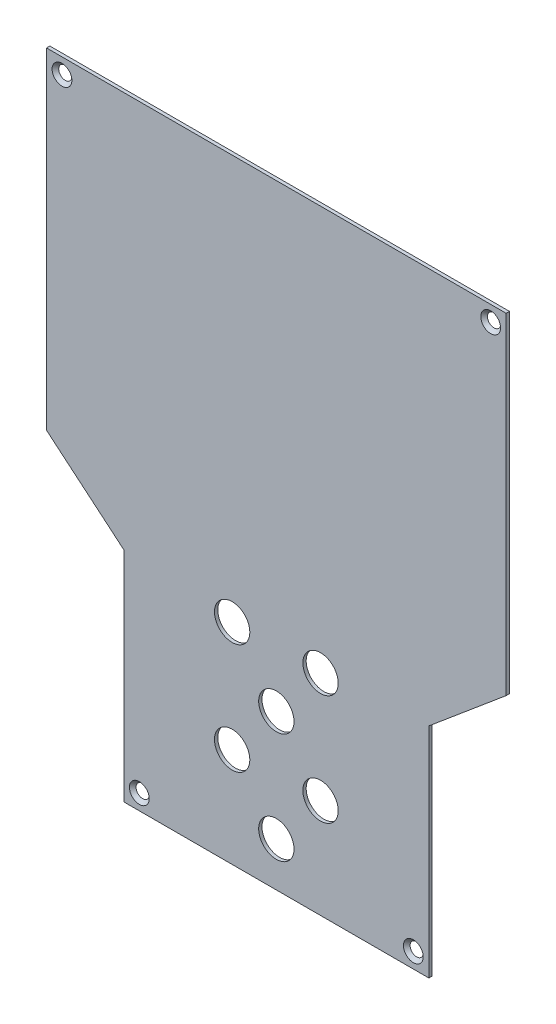
ISO-10303-21;
HEADER;
FILE_DESCRIPTION(('STEP AP214'),'2;1');
FILE_NAME('part.step','',(''),(''),'','','');
FILE_SCHEMA(('AUTOMOTIVE_DESIGN { 1 0 10303 214 1 1 1 1 }'));
ENDSEC;
DATA;
#1=APPLICATION_CONTEXT('core data for automotive mechanical design processes');
#2=APPLICATION_PROTOCOL_DEFINITION('international standard','automotive_design',2000,#1);
#3=PRODUCT_CONTEXT('',#1,'mechanical');
#4=PRODUCT('Part','Part','',(#3));
#5=PRODUCT_RELATED_PRODUCT_CATEGORY('part','',(#4));
#6=PRODUCT_DEFINITION_FORMATION('','',#4);
#7=PRODUCT_DEFINITION_CONTEXT('part definition',#1,'design');
#8=PRODUCT_DEFINITION('design','',#6,#7);
#9=PRODUCT_DEFINITION_SHAPE('','',#8);
#10=(LENGTH_UNIT() NAMED_UNIT(*) SI_UNIT(.MILLI.,.METRE.));
#11=(NAMED_UNIT(*) PLANE_ANGLE_UNIT() SI_UNIT($,.RADIAN.));
#12=(NAMED_UNIT(*) SI_UNIT($,.STERADIAN.) SOLID_ANGLE_UNIT());
#13=UNCERTAINTY_MEASURE_WITH_UNIT(LENGTH_MEASURE(1.E-05),#10,'distance_accuracy_value','');
#14=(GEOMETRIC_REPRESENTATION_CONTEXT(3) GLOBAL_UNCERTAINTY_ASSIGNED_CONTEXT((#13)) GLOBAL_UNIT_ASSIGNED_CONTEXT((#10,
#11,#12)) REPRESENTATION_CONTEXT('',''));
#15=CARTESIAN_POINT('',(0.,0.,0.));
#16=DIRECTION('',(0.,0.,1.));
#17=DIRECTION('',(1.,0.,0.));
#18=AXIS2_PLACEMENT_3D('',#15,#16,#17);
#19=CARTESIAN_POINT('',(0.,0.,0.));
#20=DIRECTION('',(0.,0.,1.));
#21=DIRECTION('',(1.,0.,0.));
#22=AXIS2_PLACEMENT_3D('',#19,#20,#21);
#23=PLANE('',#22);
#24=CARTESIAN_POINT('',(-100.139052355036,133.996609124538,0.));
#25=DIRECTION('',(0.,0.,1.));
#26=DIRECTION('',(1.,0.,0.));
#27=AXIS2_PLACEMENT_3D('',#24,#25,#26);
#28=CIRCLE('',#27,2.98);
#29=CARTESIAN_POINT('',(-97.1590523550359,133.996609124538,0.));
#30=VERTEX_POINT('',#29);
#31=EDGE_CURVE('E230',#30,#30,#28,.T.);
#32=ORIENTED_EDGE('',*,*,#31,.T.);
#33=EDGE_LOOP('',(#32));
#34=FACE_BOUND('',#33,.T.);
#35=CARTESIAN_POINT('',(58.860947644964,-130.003390875462,0.));
#36=DIRECTION('',(0.,0.,1.));
#37=DIRECTION('',(1.,0.,0.));
#38=AXIS2_PLACEMENT_3D('',#35,#36,#37);
#39=CIRCLE('',#38,2.98);
#40=CARTESIAN_POINT('',(61.840947644964,-130.003390875462,0.));
#41=VERTEX_POINT('',#40);
#42=EDGE_CURVE('E218',#41,#41,#39,.T.);
#43=ORIENTED_EDGE('',*,*,#42,.T.);
#44=EDGE_LOOP('',(#43));
#45=FACE_BOUND('',#44,.T.);
#46=CARTESIAN_POINT('',(-65.1390523550359,-130.003390875462,0.));
#47=DIRECTION('',(0.,0.,1.));
#48=DIRECTION('',(1.,0.,0.));
#49=AXIS2_PLACEMENT_3D('',#46,#47,#48);
#50=CIRCLE('',#49,2.98);
#51=CARTESIAN_POINT('',(-62.1590523550359,-130.003390875462,0.));
#52=VERTEX_POINT('',#51);
#53=EDGE_CURVE('E37',#52,#52,#50,.T.);
#54=ORIENTED_EDGE('',*,*,#53,.T.);
#55=EDGE_LOOP('',(#54));
#56=FACE_BOUND('',#55,.T.);
#57=DIRECTION('',(0.,1.,0.));
#58=VECTOR('',#57,1.);
#59=CARTESIAN_POINT('',(65.860947644964,-38.2109300542074,0.));
#60=LINE('',#59,#58);
#61=CARTESIAN_POINT('',(65.860947644964,-137.003390875462,0.));
#62=VERTEX_POINT('',#61);
#63=CARTESIAN_POINT('',(65.860947644964,-38.2109300542074,0.));
#64=VERTEX_POINT('',#63);
#65=EDGE_CURVE('E131',#62,#64,#60,.T.);
#66=ORIENTED_EDGE('',*,*,#65,.F.);
#67=DIRECTION('',(1.,0.,0.));
#68=VECTOR('',#67,1.);
#69=CARTESIAN_POINT('',(-72.1390523550359,-137.003390875462,0.));
#70=LINE('',#69,#68);
#71=CARTESIAN_POINT('',(-72.1390523550359,-137.003390875462,0.));
#72=VERTEX_POINT('',#71);
#73=EDGE_CURVE('E86',#72,#62,#70,.T.);
#74=ORIENTED_EDGE('',*,*,#73,.F.);
#75=DIRECTION('',(0.,-1.,0.));
#76=VECTOR('',#75,1.);
#77=CARTESIAN_POINT('',(-72.1390523550359,-38.2109300542074,0.));
#78=LINE('',#77,#76);
#79=CARTESIAN_POINT('',(-72.1390523550359,-38.2109300542074,0.));
#80=VERTEX_POINT('',#79);
#81=EDGE_CURVE('E80',#80,#72,#78,.T.);
#82=ORIENTED_EDGE('',*,*,#81,.F.);
#83=DIRECTION('',(0.766044443118979,-0.642787609686538,0.));
#84=VECTOR('',#83,1.);
#85=CARTESIAN_POINT('',(-107.139052355036,-8.84244296300268,0.));
#86=LINE('',#85,#84);
#87=CARTESIAN_POINT('',(-107.139052355036,-8.84244296300268,0.));
#88=VERTEX_POINT('',#87);
#89=EDGE_CURVE('E121',#88,#80,#86,.T.);
#90=ORIENTED_EDGE('',*,*,#89,.F.);
#91=DIRECTION('',(0.,-1.,0.));
#92=VECTOR('',#91,1.);
#93=CARTESIAN_POINT('',(-107.139052355036,140.996609124538,0.));
#94=LINE('',#93,#92);
#95=CARTESIAN_POINT('',(-107.139052355036,140.996609124538,0.));
#96=VERTEX_POINT('',#95);
#97=EDGE_CURVE('E141',#96,#88,#94,.T.);
#98=ORIENTED_EDGE('',*,*,#97,.F.);
#99=DIRECTION('',(-1.,0.,0.));
#100=VECTOR('',#99,1.);
#101=CARTESIAN_POINT('',(100.860947644964,140.996609124538,0.));
#102=LINE('',#101,#100);
#103=CARTESIAN_POINT('',(100.860947644964,140.996609124538,0.));
#104=VERTEX_POINT('',#103);
#105=EDGE_CURVE('E139',#104,#96,#102,.T.);
#106=ORIENTED_EDGE('',*,*,#105,.F.);
#107=DIRECTION('',(0.,1.,0.));
#108=VECTOR('',#107,1.);
#109=CARTESIAN_POINT('',(100.860947644964,140.996609124538,0.));
#110=LINE('',#109,#108);
#111=CARTESIAN_POINT('',(100.860947644964,-8.84244296300268,0.));
#112=VERTEX_POINT('',#111);
#113=EDGE_CURVE('E137',#112,#104,#110,.T.);
#114=ORIENTED_EDGE('',*,*,#113,.F.);
#115=DIRECTION('',(0.766044443118979,0.642787609686538,0.));
#116=VECTOR('',#115,1.);
#117=CARTESIAN_POINT('',(100.860947644964,-8.84244296300268,0.));
#118=LINE('',#117,#116);
#119=EDGE_CURVE('E134',#64,#112,#118,.T.);
#120=ORIENTED_EDGE('',*,*,#119,.F.);
#121=EDGE_LOOP('',(#66,#74,#82,#90,#98,#106,#114,#120));
#122=FACE_BOUND('',#121,.T.);
#123=CARTESIAN_POINT('',(-3.13905235503593,-117.003390875462,0.));
#124=DIRECTION('',(0.,0.,1.));
#125=DIRECTION('',(1.,0.,0.));
#126=AXIS2_PLACEMENT_3D('',#123,#124,#125);
#127=CIRCLE('',#126,8.00000000000001);
#128=CARTESIAN_POINT('',(4.86094764496407,-117.003390875462,0.));
#129=VERTEX_POINT('',#128);
#130=EDGE_CURVE('E135',#129,#129,#127,.T.);
#131=ORIENTED_EDGE('',*,*,#130,.T.);
#132=EDGE_LOOP('',(#131));
#133=FACE_BOUND('',#132,.T.);
#134=CARTESIAN_POINT('',(16.8609476449641,-42.0033908754623,0.));
#135=DIRECTION('',(0.,0.,1.));
#136=DIRECTION('',(-1.,0.,0.));
#137=AXIS2_PLACEMENT_3D('',#134,#135,#136);
#138=CIRCLE('',#137,8.);
#139=CARTESIAN_POINT('',(8.86094764496406,-42.0033908754623,0.));
#140=VERTEX_POINT('',#139);
#141=EDGE_CURVE('E183',#140,#140,#138,.T.);
#142=ORIENTED_EDGE('',*,*,#141,.T.);
#143=EDGE_LOOP('',(#142));
#144=FACE_BOUND('',#143,.T.);
#145=CARTESIAN_POINT('',(-23.1390523550359,-92.0033908754623,0.));
#146=DIRECTION('',(0.,0.,1.));
#147=DIRECTION('',(1.,0.,0.));
#148=AXIS2_PLACEMENT_3D('',#145,#146,#147);
#149=CIRCLE('',#148,8.00000000000002);
#150=CARTESIAN_POINT('',(-15.1390523550359,-92.0033908754623,0.));
#151=VERTEX_POINT('',#150);
#152=EDGE_CURVE('E189',#151,#151,#149,.T.);
#153=ORIENTED_EDGE('',*,*,#152,.T.);
#154=EDGE_LOOP('',(#153));
#155=FACE_BOUND('',#154,.T.);
#156=CARTESIAN_POINT('',(-3.13905235503593,-67.0033908754623,0.));
#157=DIRECTION('',(0.,0.,1.));
#158=DIRECTION('',(1.,0.,0.));
#159=AXIS2_PLACEMENT_3D('',#156,#157,#158);
#160=CIRCLE('',#159,8.00000000000001);
#161=CARTESIAN_POINT('',(4.86094764496408,-67.0033908754623,0.));
#162=VERTEX_POINT('',#161);
#163=EDGE_CURVE('E195',#162,#162,#160,.T.);
#164=ORIENTED_EDGE('',*,*,#163,.T.);
#165=EDGE_LOOP('',(#164));
#166=FACE_BOUND('',#165,.T.);
#167=CARTESIAN_POINT('',(16.8609476449641,-92.0033908754623,0.));
#168=DIRECTION('',(0.,0.,1.));
#169=DIRECTION('',(-1.,0.,0.));
#170=AXIS2_PLACEMENT_3D('',#167,#168,#169);
#171=CIRCLE('',#170,8.00000000000001);
#172=CARTESIAN_POINT('',(8.86094764496405,-92.0033908754623,0.));
#173=VERTEX_POINT('',#172);
#174=EDGE_CURVE('E201',#173,#173,#171,.T.);
#175=ORIENTED_EDGE('',*,*,#174,.T.);
#176=EDGE_LOOP('',(#175));
#177=FACE_BOUND('',#176,.T.);
#178=CARTESIAN_POINT('',(-23.1390523550359,-42.0033908754623,0.));
#179=DIRECTION('',(0.,0.,1.));
#180=DIRECTION('',(1.,0.,0.));
#181=AXIS2_PLACEMENT_3D('',#178,#179,#180);
#182=CIRCLE('',#181,8.);
#183=CARTESIAN_POINT('',(-15.1390523550359,-42.0033908754623,0.));
#184=VERTEX_POINT('',#183);
#185=EDGE_CURVE('E207',#184,#184,#182,.T.);
#186=ORIENTED_EDGE('',*,*,#185,.T.);
#187=EDGE_LOOP('',(#186));
#188=FACE_BOUND('',#187,.T.);
#189=CARTESIAN_POINT('',(93.8609476449641,133.996609124538,0.));
#190=DIRECTION('',(0.,0.,1.));
#191=DIRECTION('',(1.,0.,0.));
#192=AXIS2_PLACEMENT_3D('',#189,#190,#191);
#193=CIRCLE('',#192,2.98);
#194=CARTESIAN_POINT('',(96.840947644964,133.996609124538,0.));
#195=VERTEX_POINT('',#194);
#196=EDGE_CURVE('E224',#195,#195,#193,.T.);
#197=ORIENTED_EDGE('',*,*,#196,.T.);
#198=EDGE_LOOP('',(#197));
#199=FACE_BOUND('',#198,.T.);
#200=ADVANCED_FACE('F33',(#34,#45,#56,#122,#133,#144,#155,#166,#177,#188,#199),#23,.F.);
#201=CARTESIAN_POINT('',(65.860947644964,-38.2109300542074,1.5));
#202=DIRECTION('',(-1.,0.,0.));
#203=DIRECTION('',(0.,-1.,0.));
#204=AXIS2_PLACEMENT_3D('',#201,#202,#203);
#205=PLANE('',#204);
#206=ORIENTED_EDGE('',*,*,#65,.T.);
#207=DIRECTION('',(0.,0.,-1.));
#208=VECTOR('',#207,1.);
#209=CARTESIAN_POINT('',(65.860947644964,-38.2109300542074,1.5));
#210=LINE('',#209,#208);
#211=CARTESIAN_POINT('',(65.860947644964,-38.2109300542074,1.5));
#212=VERTEX_POINT('',#211);
#213=EDGE_CURVE('E11',#212,#64,#210,.T.);
#214=ORIENTED_EDGE('',*,*,#213,.F.);
#215=DIRECTION('',(0.,1.,0.));
#216=VECTOR('',#215,1.);
#217=CARTESIAN_POINT('',(65.860947644964,-38.2109300542074,1.5));
#218=LINE('',#217,#216);
#219=CARTESIAN_POINT('',(65.860947644964,-137.003390875462,1.5));
#220=VERTEX_POINT('',#219);
#221=EDGE_CURVE('E146',#220,#212,#218,.T.);
#222=ORIENTED_EDGE('',*,*,#221,.F.);
#223=DIRECTION('',(0.,0.,-1.));
#224=VECTOR('',#223,1.);
#225=CARTESIAN_POINT('',(65.860947644964,-137.003390875462,1.5));
#226=LINE('',#225,#224);
#227=EDGE_CURVE('E127',#220,#62,#226,.T.);
#228=ORIENTED_EDGE('',*,*,#227,.T.);
#229=EDGE_LOOP('',(#206,#214,#222,#228));
#230=FACE_BOUND('',#229,.T.);
#231=ADVANCED_FACE('F35',(#230),#205,.F.);
#232=CARTESIAN_POINT('',(100.860947644964,-8.84244296300268,1.5));
#233=DIRECTION('',(-0.642787609686538,0.766044443118979,0.));
#234=DIRECTION('',(-0.766044443118979,-0.642787609686538,0.));
#235=AXIS2_PLACEMENT_3D('',#232,#233,#234);
#236=PLANE('',#235);
#237=ORIENTED_EDGE('',*,*,#119,.T.);
#238=DIRECTION('',(0.,0.,-1.));
#239=VECTOR('',#238,1.);
#240=CARTESIAN_POINT('',(100.860947644964,-8.84244296300268,1.5));
#241=LINE('',#240,#239);
#242=CARTESIAN_POINT('',(100.860947644964,-8.84244296300268,1.5));
#243=VERTEX_POINT('',#242);
#244=EDGE_CURVE('E43',#243,#112,#241,.T.);
#245=ORIENTED_EDGE('',*,*,#244,.F.);
#246=DIRECTION('',(0.766044443118979,0.642787609686538,0.));
#247=VECTOR('',#246,1.);
#248=CARTESIAN_POINT('',(100.860947644964,-8.84244296300268,1.5));
#249=LINE('',#248,#247);
#250=EDGE_CURVE('E94',#212,#243,#249,.T.);
#251=ORIENTED_EDGE('',*,*,#250,.F.);
#252=ORIENTED_EDGE('',*,*,#213,.T.);
#253=EDGE_LOOP('',(#237,#245,#251,#252));
#254=FACE_BOUND('',#253,.T.);
#255=ADVANCED_FACE('F282',(#254),#236,.F.);
#256=CARTESIAN_POINT('',(100.860947644964,140.996609124538,1.5));
#257=DIRECTION('',(-1.,0.,0.));
#258=DIRECTION('',(0.,-1.,0.));
#259=AXIS2_PLACEMENT_3D('',#256,#257,#258);
#260=PLANE('',#259);
#261=ORIENTED_EDGE('',*,*,#113,.T.);
#262=DIRECTION('',(0.,0.,-1.));
#263=VECTOR('',#262,1.);
#264=CARTESIAN_POINT('',(100.860947644964,140.996609124538,1.5));
#265=LINE('',#264,#263);
#266=CARTESIAN_POINT('',(100.860947644964,140.996609124538,1.5));
#267=VERTEX_POINT('',#266);
#268=EDGE_CURVE('E153',#267,#104,#265,.T.);
#269=ORIENTED_EDGE('',*,*,#268,.F.);
#270=DIRECTION('',(0.,1.,0.));
#271=VECTOR('',#270,1.);
#272=CARTESIAN_POINT('',(100.860947644964,140.996609124538,1.5));
#273=LINE('',#272,#271);
#274=EDGE_CURVE('E162',#243,#267,#273,.T.);
#275=ORIENTED_EDGE('',*,*,#274,.F.);
#276=ORIENTED_EDGE('',*,*,#244,.T.);
#277=EDGE_LOOP('',(#261,#269,#275,#276));
#278=FACE_BOUND('',#277,.T.);
#279=ADVANCED_FACE('F160',(#278),#260,.F.);
#280=CARTESIAN_POINT('',(100.860947644964,140.996609124538,1.5));
#281=DIRECTION('',(0.,-1.,0.));
#282=DIRECTION('',(0.,0.,-1.));
#283=AXIS2_PLACEMENT_3D('',#280,#281,#282);
#284=PLANE('',#283);
#285=ORIENTED_EDGE('',*,*,#105,.T.);
#286=DIRECTION('',(0.,0.,-1.));
#287=VECTOR('',#286,1.);
#288=CARTESIAN_POINT('',(-107.139052355036,140.996609124538,1.5));
#289=LINE('',#288,#287);
#290=CARTESIAN_POINT('',(-107.139052355036,140.996609124538,1.5));
#291=VERTEX_POINT('',#290);
#292=EDGE_CURVE('E150',#291,#96,#289,.T.);
#293=ORIENTED_EDGE('',*,*,#292,.F.);
#294=DIRECTION('',(-1.,0.,0.));
#295=VECTOR('',#294,1.);
#296=CARTESIAN_POINT('',(100.860947644964,140.996609124538,1.5));
#297=LINE('',#296,#295);
#298=EDGE_CURVE('E174',#267,#291,#297,.T.);
#299=ORIENTED_EDGE('',*,*,#298,.F.);
#300=ORIENTED_EDGE('',*,*,#268,.T.);
#301=EDGE_LOOP('',(#285,#293,#299,#300));
#302=FACE_BOUND('',#301,.T.);
#303=ADVANCED_FACE('F170',(#302),#284,.F.);
#304=CARTESIAN_POINT('',(-107.139052355036,140.996609124538,1.5));
#305=DIRECTION('',(1.,0.,0.));
#306=DIRECTION('',(0.,1.,0.));
#307=AXIS2_PLACEMENT_3D('',#304,#305,#306);
#308=PLANE('',#307);
#309=ORIENTED_EDGE('',*,*,#97,.T.);
#310=DIRECTION('',(0.,0.,-1.));
#311=VECTOR('',#310,1.);
#312=CARTESIAN_POINT('',(-107.139052355036,-8.84244296300268,1.5));
#313=LINE('',#312,#311);
#314=CARTESIAN_POINT('',(-107.139052355036,-8.84244296300268,1.5));
#315=VERTEX_POINT('',#314);
#316=EDGE_CURVE('E122',#315,#88,#313,.T.);
#317=ORIENTED_EDGE('',*,*,#316,.F.);
#318=DIRECTION('',(0.,-1.,0.));
#319=VECTOR('',#318,1.);
#320=CARTESIAN_POINT('',(-107.139052355036,140.996609124538,1.5));
#321=LINE('',#320,#319);
#322=EDGE_CURVE('E113',#291,#315,#321,.T.);
#323=ORIENTED_EDGE('',*,*,#322,.F.);
#324=ORIENTED_EDGE('',*,*,#292,.T.);
#325=EDGE_LOOP('',(#309,#317,#323,#324));
#326=FACE_BOUND('',#325,.T.);
#327=ADVANCED_FACE('F173',(#326),#308,.F.);
#328=CARTESIAN_POINT('',(-107.139052355036,-8.84244296300268,1.5));
#329=DIRECTION('',(0.642787609686538,0.766044443118979,0.));
#330=DIRECTION('',(-0.766044443118979,0.642787609686538,0.));
#331=AXIS2_PLACEMENT_3D('',#328,#329,#330);
#332=PLANE('',#331);
#333=ORIENTED_EDGE('',*,*,#89,.T.);
#334=DIRECTION('',(0.,0.,-1.));
#335=VECTOR('',#334,1.);
#336=CARTESIAN_POINT('',(-72.1390523550359,-38.2109300542074,1.5));
#337=LINE('',#336,#335);
#338=CARTESIAN_POINT('',(-72.1390523550359,-38.2109300542074,1.5));
#339=VERTEX_POINT('',#338);
#340=EDGE_CURVE('E118',#339,#80,#337,.T.);
#341=ORIENTED_EDGE('',*,*,#340,.F.);
#342=DIRECTION('',(0.766044443118979,-0.642787609686538,0.));
#343=VECTOR('',#342,1.);
#344=CARTESIAN_POINT('',(-107.139052355036,-8.84244296300268,1.5));
#345=LINE('',#344,#343);
#346=EDGE_CURVE('E107',#315,#339,#345,.T.);
#347=ORIENTED_EDGE('',*,*,#346,.F.);
#348=ORIENTED_EDGE('',*,*,#316,.T.);
#349=EDGE_LOOP('',(#333,#341,#347,#348));
#350=FACE_BOUND('',#349,.T.);
#351=ADVANCED_FACE('F119',(#350),#332,.F.);
#352=CARTESIAN_POINT('',(-72.1390523550359,-38.2109300542074,1.5));
#353=DIRECTION('',(1.,0.,0.));
#354=DIRECTION('',(0.,1.,0.));
#355=AXIS2_PLACEMENT_3D('',#352,#353,#354);
#356=PLANE('',#355);
#357=ORIENTED_EDGE('',*,*,#81,.T.);
#358=DIRECTION('',(0.,0.,-1.));
#359=VECTOR('',#358,1.);
#360=CARTESIAN_POINT('',(-72.1390523550359,-137.003390875462,1.5));
#361=LINE('',#360,#359);
#362=CARTESIAN_POINT('',(-72.1390523550359,-137.003390875462,1.5));
#363=VERTEX_POINT('',#362);
#364=EDGE_CURVE('E123',#363,#72,#361,.T.);
#365=ORIENTED_EDGE('',*,*,#364,.F.);
#366=DIRECTION('',(0.,-1.,0.));
#367=VECTOR('',#366,1.);
#368=CARTESIAN_POINT('',(-72.1390523550359,-38.2109300542074,1.5));
#369=LINE('',#368,#367);
#370=EDGE_CURVE('E111',#339,#363,#369,.T.);
#371=ORIENTED_EDGE('',*,*,#370,.F.);
#372=ORIENTED_EDGE('',*,*,#340,.T.);
#373=EDGE_LOOP('',(#357,#365,#371,#372));
#374=FACE_BOUND('',#373,.T.);
#375=ADVANCED_FACE('F125',(#374),#356,.F.);
#376=CARTESIAN_POINT('',(-72.1390523550359,-137.003390875462,1.5));
#377=DIRECTION('',(0.,1.,0.));
#378=DIRECTION('',(0.,0.,1.));
#379=AXIS2_PLACEMENT_3D('',#376,#377,#378);
#380=PLANE('',#379);
#381=ORIENTED_EDGE('',*,*,#73,.T.);
#382=ORIENTED_EDGE('',*,*,#227,.F.);
#383=DIRECTION('',(1.,0.,0.));
#384=VECTOR('',#383,1.);
#385=CARTESIAN_POINT('',(-72.1390523550359,-137.003390875462,1.5));
#386=LINE('',#385,#384);
#387=EDGE_CURVE('E51',#363,#220,#386,.T.);
#388=ORIENTED_EDGE('',*,*,#387,.F.);
#389=ORIENTED_EDGE('',*,*,#364,.T.);
#390=EDGE_LOOP('',(#381,#382,#388,#389));
#391=FACE_BOUND('',#390,.T.);
#392=ADVANCED_FACE('F243',(#391),#380,.F.);
#393=CARTESIAN_POINT('',(0.,0.,1.5));
#394=DIRECTION('',(0.,0.,1.));
#395=DIRECTION('',(1.,0.,0.));
#396=AXIS2_PLACEMENT_3D('',#393,#394,#395);
#397=PLANE('',#396);
#398=CARTESIAN_POINT('',(-100.139052355036,133.996609124538,1.5));
#399=DIRECTION('',(0.,0.,1.));
#400=DIRECTION('',(1.,0.,0.));
#401=AXIS2_PLACEMENT_3D('',#398,#399,#400);
#402=CIRCLE('',#401,4.48);
#403=CARTESIAN_POINT('',(-95.6590523550359,133.996609124538,1.5));
#404=VERTEX_POINT('',#403);
#405=EDGE_CURVE('E233',#404,#404,#402,.T.);
#406=ORIENTED_EDGE('',*,*,#405,.F.);
#407=EDGE_LOOP('',(#406));
#408=FACE_BOUND('',#407,.T.);
#409=CARTESIAN_POINT('',(93.8609476449641,133.996609124538,1.5));
#410=DIRECTION('',(0.,0.,1.));
#411=DIRECTION('',(1.,0.,0.));
#412=AXIS2_PLACEMENT_3D('',#409,#410,#411);
#413=CIRCLE('',#412,4.48);
#414=CARTESIAN_POINT('',(98.340947644964,133.996609124538,1.5));
#415=VERTEX_POINT('',#414);
#416=EDGE_CURVE('E227',#415,#415,#413,.T.);
#417=ORIENTED_EDGE('',*,*,#416,.F.);
#418=EDGE_LOOP('',(#417));
#419=FACE_BOUND('',#418,.T.);
#420=CARTESIAN_POINT('',(58.860947644964,-130.003390875462,1.5));
#421=DIRECTION('',(0.,0.,1.));
#422=DIRECTION('',(1.,0.,0.));
#423=AXIS2_PLACEMENT_3D('',#420,#421,#422);
#424=CIRCLE('',#423,4.48);
#425=CARTESIAN_POINT('',(63.340947644964,-130.003390875462,1.5));
#426=VERTEX_POINT('',#425);
#427=EDGE_CURVE('E221',#426,#426,#424,.T.);
#428=ORIENTED_EDGE('',*,*,#427,.F.);
#429=EDGE_LOOP('',(#428));
#430=FACE_BOUND('',#429,.T.);
#431=CARTESIAN_POINT('',(-65.1390523550359,-130.003390875462,1.5));
#432=DIRECTION('',(0.,0.,1.));
#433=DIRECTION('',(1.,0.,0.));
#434=AXIS2_PLACEMENT_3D('',#431,#432,#433);
#435=CIRCLE('',#434,4.48);
#436=CARTESIAN_POINT('',(-60.6590523550359,-130.003390875462,1.5));
#437=VERTEX_POINT('',#436);
#438=EDGE_CURVE('E215',#437,#437,#435,.T.);
#439=ORIENTED_EDGE('',*,*,#438,.F.);
#440=EDGE_LOOP('',(#439));
#441=FACE_BOUND('',#440,.T.);
#442=CARTESIAN_POINT('',(-23.1390523550359,-42.0033908754623,1.5));
#443=DIRECTION('',(0.,0.,1.));
#444=DIRECTION('',(1.,0.,0.));
#445=AXIS2_PLACEMENT_3D('',#442,#443,#444);
#446=CIRCLE('',#445,8.);
#447=CARTESIAN_POINT('',(-15.1390523550359,-42.0033908754623,1.5));
#448=VERTEX_POINT('',#447);
#449=EDGE_CURVE('E210',#448,#448,#446,.T.);
#450=ORIENTED_EDGE('',*,*,#449,.F.);
#451=EDGE_LOOP('',(#450));
#452=FACE_BOUND('',#451,.T.);
#453=CARTESIAN_POINT('',(16.8609476449641,-92.0033908754623,1.5));
#454=DIRECTION('',(0.,0.,1.));
#455=DIRECTION('',(-1.,0.,0.));
#456=AXIS2_PLACEMENT_3D('',#453,#454,#455);
#457=CIRCLE('',#456,8.00000000000001);
#458=CARTESIAN_POINT('',(8.86094764496405,-92.0033908754623,1.5));
#459=VERTEX_POINT('',#458);
#460=EDGE_CURVE('E204',#459,#459,#457,.T.);
#461=ORIENTED_EDGE('',*,*,#460,.F.);
#462=EDGE_LOOP('',(#461));
#463=FACE_BOUND('',#462,.T.);
#464=CARTESIAN_POINT('',(-3.13905235503593,-67.0033908754623,1.5));
#465=DIRECTION('',(0.,0.,1.));
#466=DIRECTION('',(1.,0.,0.));
#467=AXIS2_PLACEMENT_3D('',#464,#465,#466);
#468=CIRCLE('',#467,8.00000000000001);
#469=CARTESIAN_POINT('',(4.86094764496408,-67.0033908754623,1.5));
#470=VERTEX_POINT('',#469);
#471=EDGE_CURVE('E198',#470,#470,#468,.T.);
#472=ORIENTED_EDGE('',*,*,#471,.F.);
#473=EDGE_LOOP('',(#472));
#474=FACE_BOUND('',#473,.T.);
#475=CARTESIAN_POINT('',(-23.1390523550359,-92.0033908754623,1.5));
#476=DIRECTION('',(0.,0.,1.));
#477=DIRECTION('',(1.,0.,0.));
#478=AXIS2_PLACEMENT_3D('',#475,#476,#477);
#479=CIRCLE('',#478,8.00000000000002);
#480=CARTESIAN_POINT('',(-15.1390523550359,-92.0033908754623,1.5));
#481=VERTEX_POINT('',#480);
#482=EDGE_CURVE('E192',#481,#481,#479,.T.);
#483=ORIENTED_EDGE('',*,*,#482,.F.);
#484=EDGE_LOOP('',(#483));
#485=FACE_BOUND('',#484,.T.);
#486=CARTESIAN_POINT('',(16.8609476449641,-42.0033908754623,1.5));
#487=DIRECTION('',(0.,0.,1.));
#488=DIRECTION('',(-1.,0.,0.));
#489=AXIS2_PLACEMENT_3D('',#486,#487,#488);
#490=CIRCLE('',#489,8.);
#491=CARTESIAN_POINT('',(8.86094764496406,-42.0033908754623,1.5));
#492=VERTEX_POINT('',#491);
#493=EDGE_CURVE('E186',#492,#492,#490,.T.);
#494=ORIENTED_EDGE('',*,*,#493,.F.);
#495=EDGE_LOOP('',(#494));
#496=FACE_BOUND('',#495,.T.);
#497=CARTESIAN_POINT('',(-3.13905235503593,-117.003390875462,1.5));
#498=DIRECTION('',(0.,0.,1.));
#499=DIRECTION('',(1.,0.,0.));
#500=AXIS2_PLACEMENT_3D('',#497,#498,#499);
#501=CIRCLE('',#500,8.00000000000001);
#502=CARTESIAN_POINT('',(4.86094764496407,-117.003390875462,1.5));
#503=VERTEX_POINT('',#502);
#504=EDGE_CURVE('E180',#503,#503,#501,.T.);
#505=ORIENTED_EDGE('',*,*,#504,.F.);
#506=EDGE_LOOP('',(#505));
#507=FACE_BOUND('',#506,.T.);
#508=ORIENTED_EDGE('',*,*,#221,.T.);
#509=ORIENTED_EDGE('',*,*,#250,.T.);
#510=ORIENTED_EDGE('',*,*,#274,.T.);
#511=ORIENTED_EDGE('',*,*,#298,.T.);
#512=ORIENTED_EDGE('',*,*,#322,.T.);
#513=ORIENTED_EDGE('',*,*,#346,.T.);
#514=ORIENTED_EDGE('',*,*,#370,.T.);
#515=ORIENTED_EDGE('',*,*,#387,.T.);
#516=EDGE_LOOP('',(#508,#509,#510,#511,#512,#513,#514,#515));
#517=FACE_BOUND('',#516,.T.);
#518=ADVANCED_FACE('F109',(#408,#419,#430,#441,#452,#463,#474,#485,#496,#507,#517),#397,.T.);
#519=CARTESIAN_POINT('',(-3.13905235503593,-117.003390875462,0.));
#520=DIRECTION('',(0.,0.,1.));
#521=DIRECTION('',(1.,0.,0.));
#522=AXIS2_PLACEMENT_3D('',#519,#520,#521);
#523=CYLINDRICAL_SURFACE('',#522,8.00000000000001);
#524=ORIENTED_EDGE('',*,*,#130,.F.);
#525=EDGE_LOOP('',(#524));
#526=FACE_BOUND('',#525,.T.);
#527=ORIENTED_EDGE('',*,*,#504,.T.);
#528=EDGE_LOOP('',(#527));
#529=FACE_BOUND('',#528,.T.);
#530=ADVANCED_FACE('F242',(#526,#529),#523,.F.);
#531=CARTESIAN_POINT('',(16.8609476449641,-42.0033908754623,0.));
#532=DIRECTION('',(0.,0.,1.));
#533=DIRECTION('',(1.,0.,0.));
#534=AXIS2_PLACEMENT_3D('',#531,#532,#533);
#535=CYLINDRICAL_SURFACE('',#534,8.);
#536=ORIENTED_EDGE('',*,*,#141,.F.);
#537=EDGE_LOOP('',(#536));
#538=FACE_BOUND('',#537,.T.);
#539=ORIENTED_EDGE('',*,*,#493,.T.);
#540=EDGE_LOOP('',(#539));
#541=FACE_BOUND('',#540,.T.);
#542=ADVANCED_FACE('F264',(#538,#541),#535,.F.);
#543=CARTESIAN_POINT('',(-23.1390523550359,-92.0033908754623,0.));
#544=DIRECTION('',(0.,0.,1.));
#545=DIRECTION('',(1.,0.,0.));
#546=AXIS2_PLACEMENT_3D('',#543,#544,#545);
#547=CYLINDRICAL_SURFACE('',#546,8.00000000000002);
#548=ORIENTED_EDGE('',*,*,#152,.F.);
#549=EDGE_LOOP('',(#548));
#550=FACE_BOUND('',#549,.T.);
#551=ORIENTED_EDGE('',*,*,#482,.T.);
#552=EDGE_LOOP('',(#551));
#553=FACE_BOUND('',#552,.T.);
#554=ADVANCED_FACE('F271',(#550,#553),#547,.F.);
#555=CARTESIAN_POINT('',(-3.13905235503593,-67.0033908754623,0.));
#556=DIRECTION('',(0.,0.,1.));
#557=DIRECTION('',(1.,0.,0.));
#558=AXIS2_PLACEMENT_3D('',#555,#556,#557);
#559=CYLINDRICAL_SURFACE('',#558,8.00000000000001);
#560=ORIENTED_EDGE('',*,*,#163,.F.);
#561=EDGE_LOOP('',(#560));
#562=FACE_BOUND('',#561,.T.);
#563=ORIENTED_EDGE('',*,*,#471,.T.);
#564=EDGE_LOOP('',(#563));
#565=FACE_BOUND('',#564,.T.);
#566=ADVANCED_FACE('F383',(#562,#565),#559,.F.);
#567=CARTESIAN_POINT('',(16.8609476449641,-92.0033908754623,0.));
#568=DIRECTION('',(0.,0.,1.));
#569=DIRECTION('',(1.,0.,0.));
#570=AXIS2_PLACEMENT_3D('',#567,#568,#569);
#571=CYLINDRICAL_SURFACE('',#570,8.00000000000001);
#572=ORIENTED_EDGE('',*,*,#174,.F.);
#573=EDGE_LOOP('',(#572));
#574=FACE_BOUND('',#573,.T.);
#575=ORIENTED_EDGE('',*,*,#460,.T.);
#576=EDGE_LOOP('',(#575));
#577=FACE_BOUND('',#576,.T.);
#578=ADVANCED_FACE('F379',(#574,#577),#571,.F.);
#579=CARTESIAN_POINT('',(-23.1390523550359,-42.0033908754623,0.));
#580=DIRECTION('',(0.,0.,1.));
#581=DIRECTION('',(1.,0.,0.));
#582=AXIS2_PLACEMENT_3D('',#579,#580,#581);
#583=CYLINDRICAL_SURFACE('',#582,8.);
#584=ORIENTED_EDGE('',*,*,#185,.F.);
#585=EDGE_LOOP('',(#584));
#586=FACE_BOUND('',#585,.T.);
#587=ORIENTED_EDGE('',*,*,#449,.T.);
#588=EDGE_LOOP('',(#587));
#589=FACE_BOUND('',#588,.T.);
#590=ADVANCED_FACE('F343',(#586,#589),#583,.F.);
#591=CARTESIAN_POINT('',(-65.1390523550359,-130.003390875462,1.5));
#592=DIRECTION('',(0.,0.,1.));
#593=DIRECTION('',(1.,0.,0.));
#594=AXIS2_PLACEMENT_3D('',#591,#592,#593);
#595=CONICAL_SURFACE('',#594,4.48,0.785398163397448);
#596=ORIENTED_EDGE('',*,*,#438,.T.);
#597=EDGE_LOOP('',(#596));
#598=FACE_BOUND('',#597,.T.);
#599=ORIENTED_EDGE('',*,*,#53,.F.);
#600=EDGE_LOOP('',(#599));
#601=FACE_BOUND('',#600,.T.);
#602=ADVANCED_FACE('F337',(#598,#601),#595,.F.);
#603=CARTESIAN_POINT('',(58.860947644964,-130.003390875462,1.5));
#604=DIRECTION('',(0.,0.,1.));
#605=DIRECTION('',(1.,0.,0.));
#606=AXIS2_PLACEMENT_3D('',#603,#604,#605);
#607=CONICAL_SURFACE('',#606,4.48,0.785398163397448);
#608=ORIENTED_EDGE('',*,*,#427,.T.);
#609=EDGE_LOOP('',(#608));
#610=FACE_BOUND('',#609,.T.);
#611=ORIENTED_EDGE('',*,*,#42,.F.);
#612=EDGE_LOOP('',(#611));
#613=FACE_BOUND('',#612,.T.);
#614=ADVANCED_FACE('F342',(#610,#613),#607,.F.);
#615=CARTESIAN_POINT('',(93.8609476449641,133.996609124538,1.5));
#616=DIRECTION('',(0.,0.,1.));
#617=DIRECTION('',(1.,0.,0.));
#618=AXIS2_PLACEMENT_3D('',#615,#616,#617);
#619=CONICAL_SURFACE('',#618,4.48,0.785398163397448);
#620=ORIENTED_EDGE('',*,*,#416,.T.);
#621=EDGE_LOOP('',(#620));
#622=FACE_BOUND('',#621,.T.);
#623=ORIENTED_EDGE('',*,*,#196,.F.);
#624=EDGE_LOOP('',(#623));
#625=FACE_BOUND('',#624,.T.);
#626=ADVANCED_FACE('F354',(#622,#625),#619,.F.);
#627=CARTESIAN_POINT('',(-100.139052355036,133.996609124538,1.5));
#628=DIRECTION('',(0.,0.,1.));
#629=DIRECTION('',(1.,0.,0.));
#630=AXIS2_PLACEMENT_3D('',#627,#628,#629);
#631=CONICAL_SURFACE('',#630,4.48,0.785398163397448);
#632=ORIENTED_EDGE('',*,*,#405,.T.);
#633=EDGE_LOOP('',(#632));
#634=FACE_BOUND('',#633,.T.);
#635=ORIENTED_EDGE('',*,*,#31,.F.);
#636=EDGE_LOOP('',(#635));
#637=FACE_BOUND('',#636,.T.);
#638=ADVANCED_FACE('F237',(#634,#637),#631,.F.);
#639=CLOSED_SHELL('',(#200,#231,#255,#279,#303,#327,#351,#375,#392,#518,#530,#542,#554,#566,
#578,#590,#602,#614,#626,#638));
#640=MANIFOLD_SOLID_BREP('B2',#639);
#641=ADVANCED_BREP_SHAPE_REPRESENTATION('',(#18,#640),#14);
#642=SHAPE_DEFINITION_REPRESENTATION(#9,#641);
ENDSEC;
END-ISO-10303-21;
